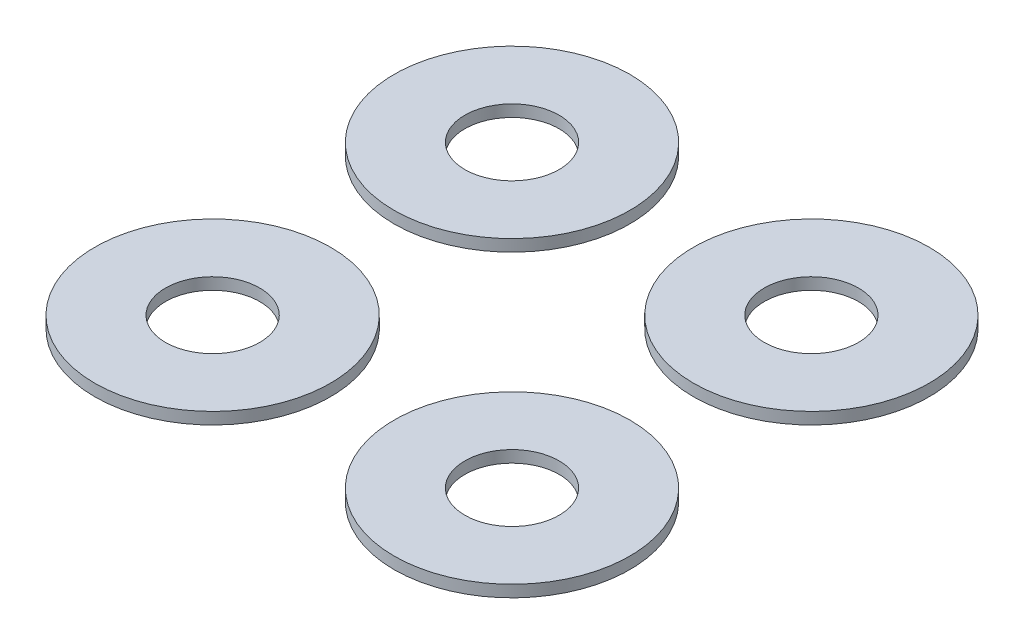
ISO-10303-21;
HEADER;
FILE_DESCRIPTION(('STEP AP214'),'2;1');
FILE_NAME('part.step','',(''),(''),'','','');
FILE_SCHEMA(('AUTOMOTIVE_DESIGN { 1 0 10303 214 1 1 1 1 }'));
ENDSEC;
DATA;
#1=APPLICATION_CONTEXT('core data for automotive mechanical design processes');
#2=APPLICATION_PROTOCOL_DEFINITION('international standard','automotive_design',2000,#1);
#3=PRODUCT_CONTEXT('',#1,'mechanical');
#4=PRODUCT('Part','Part','',(#3));
#5=PRODUCT_RELATED_PRODUCT_CATEGORY('part','',(#4));
#6=PRODUCT_DEFINITION_FORMATION('','',#4);
#7=PRODUCT_DEFINITION_CONTEXT('part definition',#1,'design');
#8=PRODUCT_DEFINITION('design','',#6,#7);
#9=PRODUCT_DEFINITION_SHAPE('','',#8);
#10=(LENGTH_UNIT() NAMED_UNIT(*) SI_UNIT(.MILLI.,.METRE.));
#11=(NAMED_UNIT(*) PLANE_ANGLE_UNIT() SI_UNIT($,.RADIAN.));
#12=(NAMED_UNIT(*) SI_UNIT($,.STERADIAN.) SOLID_ANGLE_UNIT());
#13=UNCERTAINTY_MEASURE_WITH_UNIT(LENGTH_MEASURE(1.E-05),#10,'distance_accuracy_value','');
#14=(GEOMETRIC_REPRESENTATION_CONTEXT(3) GLOBAL_UNCERTAINTY_ASSIGNED_CONTEXT((#13)) GLOBAL_UNIT_ASSIGNED_CONTEXT((#10,
#11,#12)) REPRESENTATION_CONTEXT('',''));
#15=CARTESIAN_POINT('',(0.,0.,0.));
#16=DIRECTION('',(0.,0.,1.));
#17=DIRECTION('',(1.,0.,0.));
#18=AXIS2_PLACEMENT_3D('',#15,#16,#17);
#19=CARTESIAN_POINT('',(2.54,0.1,0.));
#20=DIRECTION('',(0.,1.,0.));
#21=DIRECTION('',(0.,0.,1.));
#22=AXIS2_PLACEMENT_3D('',#19,#20,#21);
#23=PLANE('',#22);
#24=CARTESIAN_POINT('',(2.54,0.1,0.));
#25=DIRECTION('',(0.,1.,0.));
#26=DIRECTION('',(0.,0.,1.));
#27=AXIS2_PLACEMENT_3D('',#24,#25,#26);
#28=CIRCLE('',#27,1.);
#29=CARTESIAN_POINT('',(2.54,0.1,1.));
#30=VERTEX_POINT('',#29);
#31=EDGE_CURVE('E11',#30,#30,#28,.T.);
#32=ORIENTED_EDGE('',*,*,#31,.T.);
#33=EDGE_LOOP('',(#32));
#34=FACE_BOUND('',#33,.T.);
#35=CARTESIAN_POINT('',(2.54,0.1,0.));
#36=DIRECTION('',(0.,1.,0.));
#37=DIRECTION('',(0.,0.,1.));
#38=AXIS2_PLACEMENT_3D('',#35,#36,#37);
#39=CIRCLE('',#38,0.4);
#40=CARTESIAN_POINT('',(2.54,0.1,0.4));
#41=VERTEX_POINT('',#40);
#42=EDGE_CURVE('E52',#41,#41,#39,.T.);
#43=ORIENTED_EDGE('',*,*,#42,.F.);
#44=EDGE_LOOP('',(#43));
#45=FACE_BOUND('',#44,.T.);
#46=ADVANCED_FACE('F41',(#34,#45),#23,.T.);
#47=CARTESIAN_POINT('',(2.54,0.,0.));
#48=DIRECTION('',(0.,1.,0.));
#49=DIRECTION('',(0.,0.,1.));
#50=AXIS2_PLACEMENT_3D('',#47,#48,#49);
#51=PLANE('',#50);
#52=CARTESIAN_POINT('',(2.54,0.,0.));
#53=DIRECTION('',(0.,1.,0.));
#54=DIRECTION('',(0.,0.,1.));
#55=AXIS2_PLACEMENT_3D('',#52,#53,#54);
#56=CIRCLE('',#55,1.);
#57=CARTESIAN_POINT('',(2.54,0.,1.));
#58=VERTEX_POINT('',#57);
#59=EDGE_CURVE('E45',#58,#58,#56,.T.);
#60=ORIENTED_EDGE('',*,*,#59,.F.);
#61=EDGE_LOOP('',(#60));
#62=FACE_BOUND('',#61,.T.);
#63=CARTESIAN_POINT('',(2.54,0.,0.));
#64=DIRECTION('',(0.,1.,0.));
#65=DIRECTION('',(0.,0.,1.));
#66=AXIS2_PLACEMENT_3D('',#63,#64,#65);
#67=CIRCLE('',#66,0.4);
#68=CARTESIAN_POINT('',(2.54,0.,0.4));
#69=VERTEX_POINT('',#68);
#70=EDGE_CURVE('E54',#69,#69,#67,.T.);
#71=ORIENTED_EDGE('',*,*,#70,.T.);
#72=EDGE_LOOP('',(#71));
#73=FACE_BOUND('',#72,.T.);
#74=ADVANCED_FACE('F64',(#62,#73),#51,.F.);
#75=CARTESIAN_POINT('',(2.54,0.1,0.));
#76=DIRECTION('',(0.,-1.,0.));
#77=DIRECTION('',(0.,0.,-1.));
#78=AXIS2_PLACEMENT_3D('',#75,#76,#77);
#79=CYLINDRICAL_SURFACE('',#78,1.);
#80=ORIENTED_EDGE('',*,*,#31,.F.);
#81=EDGE_LOOP('',(#80));
#82=FACE_BOUND('',#81,.T.);
#83=ORIENTED_EDGE('',*,*,#59,.T.);
#84=EDGE_LOOP('',(#83));
#85=FACE_BOUND('',#84,.T.);
#86=ADVANCED_FACE('F43',(#82,#85),#79,.T.);
#87=CARTESIAN_POINT('',(2.54,0.1,0.));
#88=DIRECTION('',(0.,-1.,0.));
#89=DIRECTION('',(0.,0.,-1.));
#90=AXIS2_PLACEMENT_3D('',#87,#88,#89);
#91=CYLINDRICAL_SURFACE('',#90,0.4);
#92=ORIENTED_EDGE('',*,*,#42,.T.);
#93=EDGE_LOOP('',(#92));
#94=FACE_BOUND('',#93,.T.);
#95=ORIENTED_EDGE('',*,*,#70,.F.);
#96=EDGE_LOOP('',(#95));
#97=FACE_BOUND('',#96,.T.);
#98=ADVANCED_FACE('F60',(#94,#97),#91,.F.);
#99=CLOSED_SHELL('',(#46,#74,#86,#98));
#100=MANIFOLD_SOLID_BREP('B2',#99);
#101=CARTESIAN_POINT('',(2.54,0.1,-2.54));
#102=DIRECTION('',(0.,1.,0.));
#103=DIRECTION('',(0.,0.,1.));
#104=AXIS2_PLACEMENT_3D('',#101,#102,#103);
#105=PLANE('',#104);
#106=CARTESIAN_POINT('',(2.54,0.1,-2.54));
#107=DIRECTION('',(0.,1.,0.));
#108=DIRECTION('',(0.,0.,1.));
#109=AXIS2_PLACEMENT_3D('',#106,#107,#108);
#110=CIRCLE('',#109,1.);
#111=CARTESIAN_POINT('',(2.54,0.1,-1.54));
#112=VERTEX_POINT('',#111);
#113=EDGE_CURVE('E40',#112,#112,#110,.T.);
#114=ORIENTED_EDGE('',*,*,#113,.T.);
#115=EDGE_LOOP('',(#114));
#116=FACE_BOUND('',#115,.T.);
#117=CARTESIAN_POINT('',(2.54,0.1,-2.54));
#118=DIRECTION('',(0.,1.,0.));
#119=DIRECTION('',(0.,0.,1.));
#120=AXIS2_PLACEMENT_3D('',#117,#118,#119);
#121=CIRCLE('',#120,0.4);
#122=CARTESIAN_POINT('',(2.54,0.1,-2.14));
#123=VERTEX_POINT('',#122);
#124=EDGE_CURVE('E121',#123,#123,#121,.T.);
#125=ORIENTED_EDGE('',*,*,#124,.F.);
#126=EDGE_LOOP('',(#125));
#127=FACE_BOUND('',#126,.T.);
#128=ADVANCED_FACE('F110',(#116,#127),#105,.T.);
#129=CARTESIAN_POINT('',(2.54,0.,-2.54));
#130=DIRECTION('',(0.,1.,0.));
#131=DIRECTION('',(0.,0.,1.));
#132=AXIS2_PLACEMENT_3D('',#129,#130,#131);
#133=PLANE('',#132);
#134=CARTESIAN_POINT('',(2.54,0.,-2.54));
#135=DIRECTION('',(0.,1.,0.));
#136=DIRECTION('',(0.,0.,1.));
#137=AXIS2_PLACEMENT_3D('',#134,#135,#136);
#138=CIRCLE('',#137,1.);
#139=CARTESIAN_POINT('',(2.54,0.,-1.54));
#140=VERTEX_POINT('',#139);
#141=EDGE_CURVE('E114',#140,#140,#138,.T.);
#142=ORIENTED_EDGE('',*,*,#141,.F.);
#143=EDGE_LOOP('',(#142));
#144=FACE_BOUND('',#143,.T.);
#145=CARTESIAN_POINT('',(2.54,0.,-2.54));
#146=DIRECTION('',(0.,1.,0.));
#147=DIRECTION('',(0.,0.,1.));
#148=AXIS2_PLACEMENT_3D('',#145,#146,#147);
#149=CIRCLE('',#148,0.4);
#150=CARTESIAN_POINT('',(2.54,0.,-2.14));
#151=VERTEX_POINT('',#150);
#152=EDGE_CURVE('E123',#151,#151,#149,.T.);
#153=ORIENTED_EDGE('',*,*,#152,.T.);
#154=EDGE_LOOP('',(#153));
#155=FACE_BOUND('',#154,.T.);
#156=ADVANCED_FACE('F133',(#144,#155),#133,.F.);
#157=CARTESIAN_POINT('',(2.54,0.1,-2.54));
#158=DIRECTION('',(0.,-1.,0.));
#159=DIRECTION('',(0.,0.,-1.));
#160=AXIS2_PLACEMENT_3D('',#157,#158,#159);
#161=CYLINDRICAL_SURFACE('',#160,1.);
#162=ORIENTED_EDGE('',*,*,#113,.F.);
#163=EDGE_LOOP('',(#162));
#164=FACE_BOUND('',#163,.T.);
#165=ORIENTED_EDGE('',*,*,#141,.T.);
#166=EDGE_LOOP('',(#165));
#167=FACE_BOUND('',#166,.T.);
#168=ADVANCED_FACE('F112',(#164,#167),#161,.T.);
#169=CARTESIAN_POINT('',(2.54,0.1,-2.54));
#170=DIRECTION('',(0.,-1.,0.));
#171=DIRECTION('',(0.,0.,-1.));
#172=AXIS2_PLACEMENT_3D('',#169,#170,#171);
#173=CYLINDRICAL_SURFACE('',#172,0.4);
#174=ORIENTED_EDGE('',*,*,#124,.T.);
#175=EDGE_LOOP('',(#174));
#176=FACE_BOUND('',#175,.T.);
#177=ORIENTED_EDGE('',*,*,#152,.F.);
#178=EDGE_LOOP('',(#177));
#179=FACE_BOUND('',#178,.T.);
#180=ADVANCED_FACE('F129',(#176,#179),#173,.F.);
#181=CLOSED_SHELL('',(#128,#156,#168,#180));
#182=MANIFOLD_SOLID_BREP('B6',#181);
#183=CARTESIAN_POINT('',(0.,0.1,-2.54));
#184=DIRECTION('',(0.,1.,0.));
#185=DIRECTION('',(0.,0.,1.));
#186=AXIS2_PLACEMENT_3D('',#183,#184,#185);
#187=PLANE('',#186);
#188=CARTESIAN_POINT('',(0.,0.1,-2.54));
#189=DIRECTION('',(0.,1.,0.));
#190=DIRECTION('',(0.,0.,1.));
#191=AXIS2_PLACEMENT_3D('',#188,#189,#190);
#192=CIRCLE('',#191,1.);
#193=CARTESIAN_POINT('',(0.,0.1,-1.54));
#194=VERTEX_POINT('',#193);
#195=EDGE_CURVE('E109',#194,#194,#192,.T.);
#196=ORIENTED_EDGE('',*,*,#195,.T.);
#197=EDGE_LOOP('',(#196));
#198=FACE_BOUND('',#197,.T.);
#199=CARTESIAN_POINT('',(0.,0.1,-2.54));
#200=DIRECTION('',(0.,1.,0.));
#201=DIRECTION('',(0.,0.,1.));
#202=AXIS2_PLACEMENT_3D('',#199,#200,#201);
#203=CIRCLE('',#202,0.4);
#204=CARTESIAN_POINT('',(0.,0.1,-2.14));
#205=VERTEX_POINT('',#204);
#206=EDGE_CURVE('E189',#205,#205,#203,.T.);
#207=ORIENTED_EDGE('',*,*,#206,.F.);
#208=EDGE_LOOP('',(#207));
#209=FACE_BOUND('',#208,.T.);
#210=ADVANCED_FACE('F178',(#198,#209),#187,.T.);
#211=CARTESIAN_POINT('',(0.,0.,-2.54));
#212=DIRECTION('',(0.,1.,0.));
#213=DIRECTION('',(0.,0.,1.));
#214=AXIS2_PLACEMENT_3D('',#211,#212,#213);
#215=PLANE('',#214);
#216=CARTESIAN_POINT('',(0.,0.,-2.54));
#217=DIRECTION('',(0.,1.,0.));
#218=DIRECTION('',(0.,0.,1.));
#219=AXIS2_PLACEMENT_3D('',#216,#217,#218);
#220=CIRCLE('',#219,1.);
#221=CARTESIAN_POINT('',(0.,0.,-1.54));
#222=VERTEX_POINT('',#221);
#223=EDGE_CURVE('E182',#222,#222,#220,.T.);
#224=ORIENTED_EDGE('',*,*,#223,.F.);
#225=EDGE_LOOP('',(#224));
#226=FACE_BOUND('',#225,.T.);
#227=CARTESIAN_POINT('',(0.,0.,-2.54));
#228=DIRECTION('',(0.,1.,0.));
#229=DIRECTION('',(0.,0.,1.));
#230=AXIS2_PLACEMENT_3D('',#227,#228,#229);
#231=CIRCLE('',#230,0.4);
#232=CARTESIAN_POINT('',(0.,0.,-2.14));
#233=VERTEX_POINT('',#232);
#234=EDGE_CURVE('E191',#233,#233,#231,.T.);
#235=ORIENTED_EDGE('',*,*,#234,.T.);
#236=EDGE_LOOP('',(#235));
#237=FACE_BOUND('',#236,.T.);
#238=ADVANCED_FACE('F201',(#226,#237),#215,.F.);
#239=CARTESIAN_POINT('',(0.,0.1,-2.54));
#240=DIRECTION('',(0.,-1.,0.));
#241=DIRECTION('',(0.,0.,-1.));
#242=AXIS2_PLACEMENT_3D('',#239,#240,#241);
#243=CYLINDRICAL_SURFACE('',#242,1.);
#244=ORIENTED_EDGE('',*,*,#195,.F.);
#245=EDGE_LOOP('',(#244));
#246=FACE_BOUND('',#245,.T.);
#247=ORIENTED_EDGE('',*,*,#223,.T.);
#248=EDGE_LOOP('',(#247));
#249=FACE_BOUND('',#248,.T.);
#250=ADVANCED_FACE('F180',(#246,#249),#243,.T.);
#251=CARTESIAN_POINT('',(0.,0.1,-2.54));
#252=DIRECTION('',(0.,-1.,0.));
#253=DIRECTION('',(0.,0.,-1.));
#254=AXIS2_PLACEMENT_3D('',#251,#252,#253);
#255=CYLINDRICAL_SURFACE('',#254,0.4);
#256=ORIENTED_EDGE('',*,*,#206,.T.);
#257=EDGE_LOOP('',(#256));
#258=FACE_BOUND('',#257,.T.);
#259=ORIENTED_EDGE('',*,*,#234,.F.);
#260=EDGE_LOOP('',(#259));
#261=FACE_BOUND('',#260,.T.);
#262=ADVANCED_FACE('F197',(#258,#261),#255,.F.);
#263=CLOSED_SHELL('',(#210,#238,#250,#262));
#264=MANIFOLD_SOLID_BREP('B35',#263);
#265=CARTESIAN_POINT('',(0.,0.1,0.));
#266=DIRECTION('',(0.,1.,0.));
#267=DIRECTION('',(0.,0.,1.));
#268=AXIS2_PLACEMENT_3D('',#265,#266,#267);
#269=PLANE('',#268);
#270=CARTESIAN_POINT('',(0.,0.1,0.));
#271=DIRECTION('',(0.,1.,0.));
#272=DIRECTION('',(0.,0.,1.));
#273=AXIS2_PLACEMENT_3D('',#270,#271,#272);
#274=CIRCLE('',#273,1.);
#275=CARTESIAN_POINT('',(0.,0.1,1.));
#276=VERTEX_POINT('',#275);
#277=EDGE_CURVE('E177',#276,#276,#274,.T.);
#278=ORIENTED_EDGE('',*,*,#277,.T.);
#279=EDGE_LOOP('',(#278));
#280=FACE_BOUND('',#279,.T.);
#281=CARTESIAN_POINT('',(0.,0.1,0.));
#282=DIRECTION('',(0.,1.,0.));
#283=DIRECTION('',(0.,0.,1.));
#284=AXIS2_PLACEMENT_3D('',#281,#282,#283);
#285=CIRCLE('',#284,0.399999999999999);
#286=CARTESIAN_POINT('',(0.,0.1,0.399999999999999));
#287=VERTEX_POINT('',#286);
#288=EDGE_CURVE('E250',#287,#287,#285,.T.);
#289=ORIENTED_EDGE('',*,*,#288,.F.);
#290=EDGE_LOOP('',(#289));
#291=FACE_BOUND('',#290,.T.);
#292=ADVANCED_FACE('F239',(#280,#291),#269,.T.);
#293=CARTESIAN_POINT('',(0.,0.,0.));
#294=DIRECTION('',(0.,1.,0.));
#295=DIRECTION('',(0.,0.,1.));
#296=AXIS2_PLACEMENT_3D('',#293,#294,#295);
#297=PLANE('',#296);
#298=CARTESIAN_POINT('',(0.,0.,0.));
#299=DIRECTION('',(0.,1.,0.));
#300=DIRECTION('',(0.,0.,1.));
#301=AXIS2_PLACEMENT_3D('',#298,#299,#300);
#302=CIRCLE('',#301,1.);
#303=CARTESIAN_POINT('',(0.,0.,1.));
#304=VERTEX_POINT('',#303);
#305=EDGE_CURVE('E243',#304,#304,#302,.T.);
#306=ORIENTED_EDGE('',*,*,#305,.F.);
#307=EDGE_LOOP('',(#306));
#308=FACE_BOUND('',#307,.T.);
#309=CARTESIAN_POINT('',(0.,0.,0.));
#310=DIRECTION('',(0.,1.,0.));
#311=DIRECTION('',(0.,0.,1.));
#312=AXIS2_PLACEMENT_3D('',#309,#310,#311);
#313=CIRCLE('',#312,0.399999999999999);
#314=CARTESIAN_POINT('',(0.,0.,0.399999999999999));
#315=VERTEX_POINT('',#314);
#316=EDGE_CURVE('E252',#315,#315,#313,.T.);
#317=ORIENTED_EDGE('',*,*,#316,.T.);
#318=EDGE_LOOP('',(#317));
#319=FACE_BOUND('',#318,.T.);
#320=ADVANCED_FACE('F262',(#308,#319),#297,.F.);
#321=CARTESIAN_POINT('',(0.,0.1,0.));
#322=DIRECTION('',(0.,-1.,0.));
#323=DIRECTION('',(0.,0.,-1.));
#324=AXIS2_PLACEMENT_3D('',#321,#322,#323);
#325=CYLINDRICAL_SURFACE('',#324,1.);
#326=ORIENTED_EDGE('',*,*,#277,.F.);
#327=EDGE_LOOP('',(#326));
#328=FACE_BOUND('',#327,.T.);
#329=ORIENTED_EDGE('',*,*,#305,.T.);
#330=EDGE_LOOP('',(#329));
#331=FACE_BOUND('',#330,.T.);
#332=ADVANCED_FACE('F241',(#328,#331),#325,.T.);
#333=CARTESIAN_POINT('',(0.,0.1,0.));
#334=DIRECTION('',(0.,-1.,0.));
#335=DIRECTION('',(0.,0.,-1.));
#336=AXIS2_PLACEMENT_3D('',#333,#334,#335);
#337=CYLINDRICAL_SURFACE('',#336,0.399999999999999);
#338=ORIENTED_EDGE('',*,*,#288,.T.);
#339=EDGE_LOOP('',(#338));
#340=FACE_BOUND('',#339,.T.);
#341=ORIENTED_EDGE('',*,*,#316,.F.);
#342=EDGE_LOOP('',(#341));
#343=FACE_BOUND('',#342,.T.);
#344=ADVANCED_FACE('F258',(#340,#343),#337,.F.);
#345=CLOSED_SHELL('',(#292,#320,#332,#344));
#346=MANIFOLD_SOLID_BREP('B104',#345);
#347=ADVANCED_BREP_SHAPE_REPRESENTATION('',(#18,#100,#182,#264,#346),#14);
#348=SHAPE_DEFINITION_REPRESENTATION(#9,#347);
ENDSEC;
END-ISO-10303-21;
